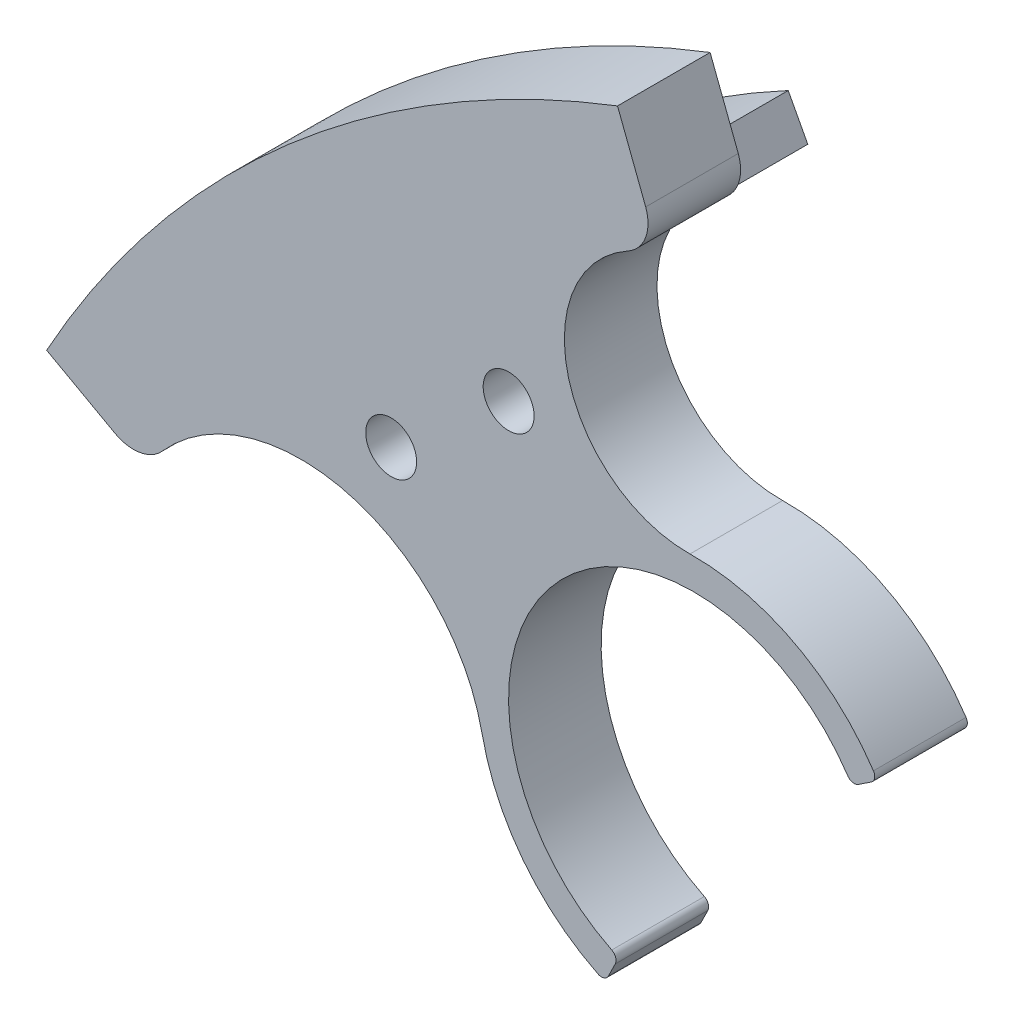
ISO-10303-21;
HEADER;
FILE_DESCRIPTION(('STEP AP214'),'2;1');
FILE_NAME('part.step','',(''),(''),'','','');
FILE_SCHEMA(('AUTOMOTIVE_DESIGN { 1 0 10303 214 1 1 1 1 }'));
ENDSEC;
DATA;
#1=APPLICATION_CONTEXT('core data for automotive mechanical design processes');
#2=APPLICATION_PROTOCOL_DEFINITION('international standard','automotive_design',2000,#1);
#3=PRODUCT_CONTEXT('',#1,'mechanical');
#4=PRODUCT('Part','Part','',(#3));
#5=PRODUCT_RELATED_PRODUCT_CATEGORY('part','',(#4));
#6=PRODUCT_DEFINITION_FORMATION('','',#4);
#7=PRODUCT_DEFINITION_CONTEXT('part definition',#1,'design');
#8=PRODUCT_DEFINITION('design','',#6,#7);
#9=PRODUCT_DEFINITION_SHAPE('','',#8);
#10=(LENGTH_UNIT() NAMED_UNIT(*) SI_UNIT(.MILLI.,.METRE.));
#11=(NAMED_UNIT(*) PLANE_ANGLE_UNIT() SI_UNIT($,.RADIAN.));
#12=(NAMED_UNIT(*) SI_UNIT($,.STERADIAN.) SOLID_ANGLE_UNIT());
#13=UNCERTAINTY_MEASURE_WITH_UNIT(LENGTH_MEASURE(1.E-05),#10,'distance_accuracy_value','');
#14=(GEOMETRIC_REPRESENTATION_CONTEXT(3) GLOBAL_UNCERTAINTY_ASSIGNED_CONTEXT((#13)) GLOBAL_UNIT_ASSIGNED_CONTEXT((#10,
#11,#12)) REPRESENTATION_CONTEXT('',''));
#15=CARTESIAN_POINT('',(0.,0.,0.));
#16=DIRECTION('',(0.,0.,1.));
#17=DIRECTION('',(1.,0.,0.));
#18=AXIS2_PLACEMENT_3D('',#15,#16,#17);
#19=CARTESIAN_POINT('',(0.,0.,6.));
#20=DIRECTION('',(0.,0.,-1.));
#21=DIRECTION('',(-1.,0.,0.));
#22=AXIS2_PLACEMENT_3D('',#19,#20,#21);
#23=CYLINDRICAL_SURFACE('',#22,71.545);
#24=CARTESIAN_POINT('',(0.,0.,0.));
#25=DIRECTION('',(0.,0.,1.));
#26=DIRECTION('',(-1.,0.,0.));
#27=AXIS2_PLACEMENT_3D('',#24,#25,#26);
#28=CIRCLE('',#27,71.545);
#29=CARTESIAN_POINT('',(-25.6394349502181,66.7930116137425,0.));
#30=VERTEX_POINT('',#29);
#31=CARTESIAN_POINT('',(-62.6290739033732,34.5873694721906,0.));
#32=VERTEX_POINT('',#31);
#33=EDGE_CURVE('E418',#30,#32,#28,.T.);
#34=ORIENTED_EDGE('',*,*,#33,.T.);
#35=DIRECTION('',(0.,0.,-1.));
#36=VECTOR('',#35,1.);
#37=CARTESIAN_POINT('',(-62.6290739033732,34.5873694721906,6.));
#38=LINE('',#37,#36);
#39=CARTESIAN_POINT('',(-62.6290739033732,34.5873694721906,6.));
#40=VERTEX_POINT('',#39);
#41=EDGE_CURVE('E429',#40,#32,#38,.T.);
#42=ORIENTED_EDGE('',*,*,#41,.F.);
#43=CARTESIAN_POINT('',(0.,0.,6.));
#44=DIRECTION('',(0.,0.,1.));
#45=DIRECTION('',(-1.,0.,0.));
#46=AXIS2_PLACEMENT_3D('',#43,#44,#45);
#47=CIRCLE('',#46,71.545);
#48=CARTESIAN_POINT('',(-25.6394349502181,66.7930116137425,6.));
#49=VERTEX_POINT('',#48);
#50=EDGE_CURVE('E419',#49,#40,#47,.T.);
#51=ORIENTED_EDGE('',*,*,#50,.F.);
#52=DIRECTION('',(0.,0.,-1.));
#53=VECTOR('',#52,1.);
#54=CARTESIAN_POINT('',(-25.6394349502181,66.7930116137425,6.));
#55=LINE('',#54,#53);
#56=EDGE_CURVE('E426',#49,#30,#55,.T.);
#57=ORIENTED_EDGE('',*,*,#56,.T.);
#58=EDGE_LOOP('',(#34,#42,#51,#57));
#59=FACE_BOUND('',#58,.T.);
#60=ADVANCED_FACE('F91',(#59),#23,.T.);
#61=CARTESIAN_POINT('',(-62.6290739033732,34.5873694721906,6.));
#62=DIRECTION('',(0.483435173278224,0.87538016497831,0.));
#63=DIRECTION('',(-0.87538016497831,0.483435173278225,0.));
#64=AXIS2_PLACEMENT_3D('',#61,#62,#63);
#65=PLANE('',#64);
#66=DIRECTION('',(0.87538016497831,-0.483435173278225,0.));
#67=VECTOR('',#66,1.);
#68=CARTESIAN_POINT('',(-62.6290739033732,34.5873694721906,0.));
#69=LINE('',#68,#67);
#70=CARTESIAN_POINT('',(-58.1699561421059,32.1247886943411,0.));
#71=VERTEX_POINT('',#70);
#72=EDGE_CURVE('E425',#32,#71,#69,.T.);
#73=ORIENTED_EDGE('',*,*,#72,.T.);
#74=DIRECTION('',(0.,0.,-1.));
#75=VECTOR('',#74,1.);
#76=CARTESIAN_POINT('',(-58.169956142106,32.1247886943412,6.));
#77=LINE('',#76,#75);
#78=CARTESIAN_POINT('',(-58.169956142106,32.1247886943412,6.));
#79=VERTEX_POINT('',#78);
#80=EDGE_CURVE('E100',#79,#71,#77,.T.);
#81=ORIENTED_EDGE('',*,*,#80,.F.);
#82=DIRECTION('',(0.87538016497831,-0.483435173278225,0.));
#83=VECTOR('',#82,1.);
#84=CARTESIAN_POINT('',(-62.6290739033732,34.5873694721906,6.));
#85=LINE('',#84,#83);
#86=EDGE_CURVE('E94',#40,#79,#85,.T.);
#87=ORIENTED_EDGE('',*,*,#86,.F.);
#88=ORIENTED_EDGE('',*,*,#41,.T.);
#89=EDGE_LOOP('',(#73,#81,#87,#88));
#90=FACE_BOUND('',#89,.T.);
#91=ADVANCED_FACE('F449',(#90),#65,.F.);
#92=CARTESIAN_POINT('',(-25.6394349502181,66.7930116137425,6.));
#93=DIRECTION('',(-0.933580426497203,-0.358367949545296,0.));
#94=DIRECTION('',(0.358367949545296,-0.933580426497203,0.));
#95=AXIS2_PLACEMENT_3D('',#92,#93,#94);
#96=PLANE('',#95);
#97=DIRECTION('',(-0.358367949545296,0.933580426497203,0.));
#98=VECTOR('',#97,1.);
#99=CARTESIAN_POINT('',(-25.6394349502181,66.7930116137425,0.));
#100=LINE('',#99,#98);
#101=CARTESIAN_POINT('',(-23.8139367806016,62.0374262944559,0.));
#102=VERTEX_POINT('',#101);
#103=EDGE_CURVE('E422',#102,#30,#100,.T.);
#104=ORIENTED_EDGE('',*,*,#103,.T.);
#105=ORIENTED_EDGE('',*,*,#56,.F.);
#106=DIRECTION('',(-0.358367949545296,0.933580426497203,0.));
#107=VECTOR('',#106,1.);
#108=CARTESIAN_POINT('',(-25.6394349502181,66.7930116137425,6.));
#109=LINE('',#108,#107);
#110=CARTESIAN_POINT('',(-23.8139367806016,62.0374262944559,6.));
#111=VERTEX_POINT('',#110);
#112=EDGE_CURVE('E108',#111,#49,#109,.T.);
#113=ORIENTED_EDGE('',*,*,#112,.F.);
#114=DIRECTION('',(0.,0.,-1.));
#115=VECTOR('',#114,1.);
#116=CARTESIAN_POINT('',(-23.8139367806016,62.0374262944559,6.));
#117=LINE('',#116,#115);
#118=EDGE_CURVE('E12',#102,#111,#117,.F.);
#119=ORIENTED_EDGE('',*,*,#118,.F.);
#120=EDGE_LOOP('',(#104,#105,#113,#119));
#121=FACE_BOUND('',#120,.T.);
#122=ADVANCED_FACE('F511',(#121),#96,.F.);
#123=CARTESIAN_POINT('',(0.,0.,6.));
#124=DIRECTION('',(0.,0.,-1.));
#125=DIRECTION('',(-1.,0.,0.));
#126=AXIS2_PLACEMENT_3D('',#123,#124,#125);
#127=PLANE('',#126);
#128=CARTESIAN_POINT('',(-40.305086527633,40.3050865276334,6.));
#129=DIRECTION('',(0.,0.,1.));
#130=DIRECTION('',(1.,0.,0.));
#131=AXIS2_PLACEMENT_3D('',#128,#129,#130);
#132=CIRCLE('',#131,1.65);
#133=CARTESIAN_POINT('',(-38.655086527633,40.3050865276334,6.));
#134=VERTEX_POINT('',#133);
#135=EDGE_CURVE('E321',#134,#134,#132,.T.);
#136=ORIENTED_EDGE('',*,*,#135,.F.);
#137=EDGE_LOOP('',(#136));
#138=FACE_BOUND('',#137,.T.);
#139=CARTESIAN_POINT('',(-32.6938568720097,46.6916665244725,6.));
#140=DIRECTION('',(0.,0.,1.));
#141=DIRECTION('',(1.,0.,0.));
#142=AXIS2_PLACEMENT_3D('',#139,#140,#141);
#143=CIRCLE('',#142,1.65);
#144=CARTESIAN_POINT('',(-31.0438568720097,46.6916665244725,6.));
#145=VERTEX_POINT('',#144);
#146=EDGE_CURVE('E287',#145,#145,#143,.T.);
#147=ORIENTED_EDGE('',*,*,#146,.F.);
#148=EDGE_LOOP('',(#147));
#149=FACE_BOUND('',#148,.T.);
#150=ORIENTED_EDGE('',*,*,#86,.T.);
#151=CARTESIAN_POINT('',(-57.0026899205681,34.3355554319362,6.));
#152=DIRECTION('',(0.,0.,1.));
#153=DIRECTION('',(1.,0.,0.));
#154=AXIS2_PLACEMENT_3D('',#151,#152,#153);
#155=CIRCLE('',#154,2.5);
#156=CARTESIAN_POINT('',(-55.1326712321369,32.6763296772789,6.));
#157=VERTEX_POINT('',#156);
#158=EDGE_CURVE('E346',#79,#157,#155,.T.);
#159=ORIENTED_EDGE('',*,*,#158,.T.);
#160=CARTESIAN_POINT('',(-46.156581527667,24.7120460549241,6.));
#161=DIRECTION('',(0.,0.,-1.));
#162=DIRECTION('',(-1.,0.,0.));
#163=AXIS2_PLACEMENT_3D('',#160,#161,#162);
#164=CIRCLE('',#163,12.);
#165=CARTESIAN_POINT('',(-34.4073900533592,27.1526401834206,6.));
#166=VERTEX_POINT('',#165);
#167=EDGE_CURVE('E348',#157,#166,#164,.T.);
#168=ORIENTED_EDGE('',*,*,#167,.T.);
#169=CARTESIAN_POINT('',(-20.7,30.,6.));
#170=DIRECTION('',(0.,0.,1.));
#171=DIRECTION('',(1.,0.,0.));
#172=AXIS2_PLACEMENT_3D('',#169,#170,#171);
#173=CIRCLE('',#172,14.);
#174=CARTESIAN_POINT('',(-26.8982489467865,17.4468446200304,6.));
#175=VERTEX_POINT('',#174);
#176=EDGE_CURVE('E350',#166,#175,#173,.T.);
#177=ORIENTED_EDGE('',*,*,#176,.T.);
#178=CARTESIAN_POINT('',(-26.6768829129727,17.8951715978864,6.));
#179=DIRECTION('',(0.,0.,1.));
#180=DIRECTION('',(1.,0.,0.));
#181=AXIS2_PLACEMENT_3D('',#178,#179,#180);
#182=CIRCLE('',#181,0.500000000000003);
#183=CARTESIAN_POINT('',(-26.2285559351166,17.6738055640726,6.));
#184=VERTEX_POINT('',#183);
#185=EDGE_CURVE('E352',#175,#184,#182,.T.);
#186=ORIENTED_EDGE('',*,*,#185,.T.);
#187=DIRECTION('',(0.442732067627607,0.896653955712115,0.));
#188=VECTOR('',#187,1.);
#189=CARTESIAN_POINT('',(-26.2285559351166,17.6738055640726,6.));
#190=LINE('',#189,#188);
#191=CARTESIAN_POINT('',(-25.785823867489,18.5704595197847,6.));
#192=VERTEX_POINT('',#191);
#193=EDGE_CURVE('E354',#184,#192,#190,.T.);
#194=ORIENTED_EDGE('',*,*,#193,.T.);
#195=CARTESIAN_POINT('',(-26.2341508453451,18.7918255535985,6.));
#196=DIRECTION('',(0.,0.,1.));
#197=DIRECTION('',(1.,0.,0.));
#198=AXIS2_PLACEMENT_3D('',#195,#196,#197);
#199=CIRCLE('',#198,0.499999999999999);
#200=CARTESIAN_POINT('',(-26.0127848115313,19.2401525314546,6.));
#201=VERTEX_POINT('',#200);
#202=EDGE_CURVE('E327',#192,#201,#199,.T.);
#203=ORIENTED_EDGE('',*,*,#202,.T.);
#204=CARTESIAN_POINT('',(-20.7,30.,6.));
#205=DIRECTION('',(0.,0.,-1.));
#206=DIRECTION('',(-1.,0.,0.));
#207=AXIS2_PLACEMENT_3D('',#204,#205,#206);
#208=CIRCLE('',#207,12.);
#209=CARTESIAN_POINT('',(-10.7190696541011,36.6619088428404,6.));
#210=VERTEX_POINT('',#209);
#211=EDGE_CURVE('E330',#201,#210,#208,.T.);
#212=ORIENTED_EDGE('',*,*,#211,.T.);
#213=CARTESIAN_POINT('',(-10.3031975563554,36.9394883779588,6.));
#214=DIRECTION('',(0.,0.,1.));
#215=DIRECTION('',(-1.,0.,0.));
#216=AXIS2_PLACEMENT_3D('',#213,#214,#215);
#217=CIRCLE('',#216,0.500000000000007);
#218=CARTESIAN_POINT('',(-10.025618021237,36.523616280213,6.));
#219=VERTEX_POINT('',#218);
#220=EDGE_CURVE('E333',#210,#219,#217,.T.);
#221=ORIENTED_EDGE('',*,*,#220,.T.);
#222=DIRECTION('',(0.831744195491571,0.555159070236702,0.));
#223=VECTOR('',#222,1.);
#224=CARTESIAN_POINT('',(-9.19387382574542,37.0787753504497,6.));
#225=LINE('',#224,#223);
#226=CARTESIAN_POINT('',(-9.19387382574542,37.0787753504497,6.));
#227=VERTEX_POINT('',#226);
#228=EDGE_CURVE('E335',#219,#227,#225,.T.);
#229=ORIENTED_EDGE('',*,*,#228,.T.);
#230=CARTESIAN_POINT('',(-9.47145336086377,37.4946474481955,6.));
#231=DIRECTION('',(0.,0.,1.));
#232=DIRECTION('',(-1.,0.,0.));
#233=AXIS2_PLACEMENT_3D('',#230,#231,#232);
#234=CIRCLE('',#233,0.500000000000005);
#235=CARTESIAN_POINT('',(-9.05558126311798,37.7722269833138,6.));
#236=VERTEX_POINT('',#235);
#237=EDGE_CURVE('E337',#227,#236,#234,.T.);
#238=ORIENTED_EDGE('',*,*,#237,.T.);
#239=CARTESIAN_POINT('',(-20.7,30.,6.));
#240=DIRECTION('',(0.,0.,1.));
#241=DIRECTION('',(1.,0.,0.));
#242=AXIS2_PLACEMENT_3D('',#239,#240,#241);
#243=CIRCLE('',#242,14.);
#244=CARTESIAN_POINT('',(-20.9440148083786,43.9978732946577,6.));
#245=VERTEX_POINT('',#244);
#246=EDGE_CURVE('E339',#236,#245,#243,.T.);
#247=ORIENTED_EDGE('',*,*,#246,.T.);
#248=CARTESIAN_POINT('',(-21.0834518417378,51.9966580344622,6.));
#249=DIRECTION('',(0.,0.,-1.));
#250=DIRECTION('',(1.,0.,0.));
#251=AXIS2_PLACEMENT_3D('',#248,#249,#250);
#252=CIRCLE('',#251,8.);
#253=CARTESIAN_POINT('',(-24.9545782518794,58.99768512459,6.));
#254=VERTEX_POINT('',#253);
#255=EDGE_CURVE('E341',#245,#254,#252,.T.);
#256=ORIENTED_EDGE('',*,*,#255,.T.);
#257=CARTESIAN_POINT('',(-26.1643052550486,61.185506090255,6.));
#258=DIRECTION('',(0.,0.,1.));
#259=DIRECTION('',(-1.,0.,0.));
#260=AXIS2_PLACEMENT_3D('',#257,#258,#259);
#261=CIRCLE('',#260,2.50000000000001);
#262=EDGE_CURVE('E343',#254,#111,#261,.T.);
#263=ORIENTED_EDGE('',*,*,#262,.T.);
#264=ORIENTED_EDGE('',*,*,#112,.T.);
#265=ORIENTED_EDGE('',*,*,#50,.T.);
#266=EDGE_LOOP('',(#150,#159,#168,#177,#186,#194,#203,#212,#221,#229,#238,#247,#256,#263,#264,#265));
#267=FACE_BOUND('',#266,.T.);
#268=ADVANCED_FACE('F442',(#138,#149,#267),#127,.F.);
#269=CARTESIAN_POINT('',(0.,0.,0.));
#270=DIRECTION('',(0.,0.,-1.));
#271=DIRECTION('',(-1.,0.,0.));
#272=AXIS2_PLACEMENT_3D('',#269,#270,#271);
#273=PLANE('',#272);
#274=CARTESIAN_POINT('',(-57.0026899205681,34.3355554319362,0.));
#275=DIRECTION('',(0.,0.,1.));
#276=DIRECTION('',(1.,0.,0.));
#277=AXIS2_PLACEMENT_3D('',#274,#275,#276);
#278=CIRCLE('',#277,2.5);
#279=CARTESIAN_POINT('',(-55.1326712321369,32.6763296772789,0.));
#280=VERTEX_POINT('',#279);
#281=EDGE_CURVE('E374',#71,#280,#278,.T.);
#282=ORIENTED_EDGE('',*,*,#281,.F.);
#283=ORIENTED_EDGE('',*,*,#72,.F.);
#284=ORIENTED_EDGE('',*,*,#33,.F.);
#285=ORIENTED_EDGE('',*,*,#103,.F.);
#286=CARTESIAN_POINT('',(-26.1643052550486,61.185506090255,0.));
#287=DIRECTION('',(0.,0.,1.));
#288=DIRECTION('',(-1.,0.,0.));
#289=AXIS2_PLACEMENT_3D('',#286,#287,#288);
#290=CIRCLE('',#289,2.50000000000001);
#291=CARTESIAN_POINT('',(-24.9545782518794,58.99768512459,0.));
#292=VERTEX_POINT('',#291);
#293=EDGE_CURVE('E371',#292,#102,#290,.T.);
#294=ORIENTED_EDGE('',*,*,#293,.F.);
#295=CARTESIAN_POINT('',(-21.0834518417378,51.9966580344622,0.));
#296=DIRECTION('',(0.,0.,-1.));
#297=DIRECTION('',(1.,0.,0.));
#298=AXIS2_PLACEMENT_3D('',#295,#296,#297);
#299=CIRCLE('',#298,8.);
#300=CARTESIAN_POINT('',(-20.9440148083786,43.9978732946577,0.));
#301=VERTEX_POINT('',#300);
#302=EDGE_CURVE('E369',#301,#292,#299,.T.);
#303=ORIENTED_EDGE('',*,*,#302,.F.);
#304=CARTESIAN_POINT('',(-20.7,30.,0.));
#305=DIRECTION('',(0.,0.,1.));
#306=DIRECTION('',(1.,0.,0.));
#307=AXIS2_PLACEMENT_3D('',#304,#305,#306);
#308=CIRCLE('',#307,14.);
#309=CARTESIAN_POINT('',(-9.05558126311798,37.7722269833138,0.));
#310=VERTEX_POINT('',#309);
#311=EDGE_CURVE('E367',#310,#301,#308,.T.);
#312=ORIENTED_EDGE('',*,*,#311,.F.);
#313=CARTESIAN_POINT('',(-9.47145336086377,37.4946474481955,0.));
#314=DIRECTION('',(0.,0.,1.));
#315=DIRECTION('',(-1.,0.,0.));
#316=AXIS2_PLACEMENT_3D('',#313,#314,#315);
#317=CIRCLE('',#316,0.500000000000005);
#318=CARTESIAN_POINT('',(-9.19387382574542,37.0787753504497,0.));
#319=VERTEX_POINT('',#318);
#320=EDGE_CURVE('E365',#319,#310,#317,.T.);
#321=ORIENTED_EDGE('',*,*,#320,.F.);
#322=DIRECTION('',(0.831744195491571,0.555159070236702,0.));
#323=VECTOR('',#322,1.);
#324=CARTESIAN_POINT('',(-9.19387382574542,37.0787753504497,0.));
#325=LINE('',#324,#323);
#326=CARTESIAN_POINT('',(-10.025618021237,36.523616280213,0.));
#327=VERTEX_POINT('',#326);
#328=EDGE_CURVE('E363',#327,#319,#325,.T.);
#329=ORIENTED_EDGE('',*,*,#328,.F.);
#330=CARTESIAN_POINT('',(-10.3031975563554,36.9394883779588,0.));
#331=DIRECTION('',(0.,0.,1.));
#332=DIRECTION('',(-1.,0.,0.));
#333=AXIS2_PLACEMENT_3D('',#330,#331,#332);
#334=CIRCLE('',#333,0.500000000000007);
#335=CARTESIAN_POINT('',(-10.7190696541011,36.6619088428404,0.));
#336=VERTEX_POINT('',#335);
#337=EDGE_CURVE('E361',#336,#327,#334,.T.);
#338=ORIENTED_EDGE('',*,*,#337,.F.);
#339=CARTESIAN_POINT('',(-20.7,30.,0.));
#340=DIRECTION('',(0.,0.,-1.));
#341=DIRECTION('',(-1.,0.,0.));
#342=AXIS2_PLACEMENT_3D('',#339,#340,#341);
#343=CIRCLE('',#342,12.);
#344=CARTESIAN_POINT('',(-26.0127848115313,19.2401525314546,0.));
#345=VERTEX_POINT('',#344);
#346=EDGE_CURVE('E359',#345,#336,#343,.T.);
#347=ORIENTED_EDGE('',*,*,#346,.F.);
#348=CARTESIAN_POINT('',(-26.2341508453451,18.7918255535985,0.));
#349=DIRECTION('',(0.,0.,1.));
#350=DIRECTION('',(1.,0.,0.));
#351=AXIS2_PLACEMENT_3D('',#348,#349,#350);
#352=CIRCLE('',#351,0.499999999999999);
#353=CARTESIAN_POINT('',(-25.785823867489,18.5704595197847,0.));
#354=VERTEX_POINT('',#353);
#355=EDGE_CURVE('E324',#354,#345,#352,.T.);
#356=ORIENTED_EDGE('',*,*,#355,.F.);
#357=DIRECTION('',(0.442732067627607,0.896653955712115,0.));
#358=VECTOR('',#357,1.);
#359=CARTESIAN_POINT('',(-26.2285559351166,17.6738055640726,0.));
#360=LINE('',#359,#358);
#361=CARTESIAN_POINT('',(-26.2285559351166,17.6738055640726,0.));
#362=VERTEX_POINT('',#361);
#363=EDGE_CURVE('E331',#362,#354,#360,.T.);
#364=ORIENTED_EDGE('',*,*,#363,.F.);
#365=CARTESIAN_POINT('',(-26.6768829129727,17.8951715978864,0.));
#366=DIRECTION('',(0.,0.,1.));
#367=DIRECTION('',(1.,0.,0.));
#368=AXIS2_PLACEMENT_3D('',#365,#366,#367);
#369=CIRCLE('',#368,0.500000000000003);
#370=CARTESIAN_POINT('',(-26.8982489467865,17.4468446200304,0.));
#371=VERTEX_POINT('',#370);
#372=EDGE_CURVE('E380',#371,#362,#369,.T.);
#373=ORIENTED_EDGE('',*,*,#372,.F.);
#374=CARTESIAN_POINT('',(-20.7,30.,0.));
#375=DIRECTION('',(0.,0.,1.));
#376=DIRECTION('',(1.,0.,0.));
#377=AXIS2_PLACEMENT_3D('',#374,#375,#376);
#378=CIRCLE('',#377,14.);
#379=CARTESIAN_POINT('',(-34.4073900533592,27.1526401834206,0.));
#380=VERTEX_POINT('',#379);
#381=EDGE_CURVE('E378',#380,#371,#378,.T.);
#382=ORIENTED_EDGE('',*,*,#381,.F.);
#383=CARTESIAN_POINT('',(-46.156581527667,24.7120460549241,0.));
#384=DIRECTION('',(0.,0.,-1.));
#385=DIRECTION('',(-1.,0.,0.));
#386=AXIS2_PLACEMENT_3D('',#383,#384,#385);
#387=CIRCLE('',#386,12.);
#388=EDGE_CURVE('E376',#280,#380,#387,.T.);
#389=ORIENTED_EDGE('',*,*,#388,.F.);
#390=EDGE_LOOP('',(#282,#283,#284,#285,#294,#303,#312,#321,#329,#338,#347,#356,#364,#373,#382,#389));
#391=FACE_BOUND('',#390,.T.);
#392=CARTESIAN_POINT('',(-40.305086527633,40.3050865276334,0.));
#393=DIRECTION('',(0.,0.,1.));
#394=DIRECTION('',(1.,0.,0.));
#395=AXIS2_PLACEMENT_3D('',#392,#393,#394);
#396=CIRCLE('',#395,2.75);
#397=CARTESIAN_POINT('',(-37.555086527633,40.3050865276334,0.));
#398=VERTEX_POINT('',#397);
#399=EDGE_CURVE('E522',#398,#398,#396,.T.);
#400=ORIENTED_EDGE('',*,*,#399,.T.);
#401=EDGE_LOOP('',(#400));
#402=FACE_BOUND('',#401,.T.);
#403=CARTESIAN_POINT('',(-32.6938568720097,46.6916665244725,0.));
#404=DIRECTION('',(0.,0.,1.));
#405=DIRECTION('',(1.,0.,0.));
#406=AXIS2_PLACEMENT_3D('',#403,#404,#405);
#407=CIRCLE('',#406,2.75);
#408=CARTESIAN_POINT('',(-29.9438568720097,46.6916665244725,0.));
#409=VERTEX_POINT('',#408);
#410=EDGE_CURVE('E526',#409,#409,#407,.T.);
#411=ORIENTED_EDGE('',*,*,#410,.T.);
#412=EDGE_LOOP('',(#411));
#413=FACE_BOUND('',#412,.T.);
#414=DIRECTION('',(0.642787609686536,-0.766044443118981,0.));
#415=VECTOR('',#414,1.);
#416=CARTESIAN_POINT('',(0.114906666467888,0.0964181414530143,0.));
#417=LINE('',#416,#415);
#418=CARTESIAN_POINT('',(-41.5697583125246,49.7742673862539,0.));
#419=VERTEX_POINT('',#418);
#420=CARTESIAN_POINT('',(-39.8342269220324,47.7059416165747,0.));
#421=VERTEX_POINT('',#420);
#422=EDGE_CURVE('E305',#419,#421,#417,.T.);
#423=ORIENTED_EDGE('',*,*,#422,.T.);
#424=CARTESIAN_POINT('',(0.,0.,0.));
#425=DIRECTION('',(0.,0.,-1.));
#426=DIRECTION('',(0.,-1.,0.));
#427=AXIS2_PLACEMENT_3D('',#424,#425,#426);
#428=CIRCLE('',#427,62.15);
#429=CARTESIAN_POINT('',(-29.3100147851746,54.8046123359416,0.));
#430=VERTEX_POINT('',#429);
#431=EDGE_CURVE('E309',#421,#430,#428,.T.);
#432=ORIENTED_EDGE('',*,*,#431,.T.);
#433=DIRECTION('',(-0.469471562785891,0.882947592858927,0.));
#434=VECTOR('',#433,1.);
#435=CARTESIAN_POINT('',(-0.132442138928858,-0.0704207344178939,0.));
#436=LINE('',#435,#434);
#437=CARTESIAN_POINT('',(-30.5775915428469,57.1885774909537,0.));
#438=VERTEX_POINT('',#437);
#439=EDGE_CURVE('E293',#430,#438,#436,.T.);
#440=ORIENTED_EDGE('',*,*,#439,.T.);
#441=CARTESIAN_POINT('',(0.,0.,0.));
#442=DIRECTION('',(0.,0.,-1.));
#443=DIRECTION('',(0.,-1.,0.));
#444=AXIS2_PLACEMENT_3D('',#441,#442,#443);
#445=CIRCLE('',#444,64.85);
#446=EDGE_CURVE('E303',#438,#419,#445,.F.);
#447=ORIENTED_EDGE('',*,*,#446,.T.);
#448=EDGE_LOOP('',(#423,#432,#440,#447));
#449=FACE_BOUND('',#448,.T.);
#450=DIRECTION('',(0.798635510047282,-0.601815023152063,0.));
#451=VECTOR('',#450,1.);
#452=CARTESIAN_POINT('',(0.0902722534728621,0.119795326507162,0.));
#453=LINE('',#452,#451);
#454=CARTESIAN_POINT('',(-51.7011020278119,39.1473951765605,0.));
#455=VERTEX_POINT('',#454);
#456=CARTESIAN_POINT('',(-49.5447801318053,37.5224900784993,0.));
#457=VERTEX_POINT('',#456);
#458=EDGE_CURVE('E280',#455,#457,#453,.T.);
#459=ORIENTED_EDGE('',*,*,#458,.T.);
#460=CARTESIAN_POINT('',(0.,0.,0.));
#461=DIRECTION('',(0.,0.,-1.));
#462=DIRECTION('',(0.,-1.,0.));
#463=AXIS2_PLACEMENT_3D('',#460,#461,#462);
#464=CIRCLE('',#463,62.15);
#465=CARTESIAN_POINT('',(-44.0526244717368,43.8404924373819,0.));
#466=VERTEX_POINT('',#465);
#467=EDGE_CURVE('E284',#457,#466,#464,.T.);
#468=ORIENTED_EDGE('',*,*,#467,.T.);
#469=DIRECTION('',(-0.707106781186538,0.707106781186557,0.));
#470=VECTOR('',#469,1.);
#471=CARTESIAN_POINT('',(-0.106066017178016,-0.106066017178013,0.));
#472=LINE('',#471,#470);
#473=CARTESIAN_POINT('',(-45.9618181100174,45.7496860756626,0.));
#474=VERTEX_POINT('',#473);
#475=EDGE_CURVE('E255',#466,#474,#472,.T.);
#476=ORIENTED_EDGE('',*,*,#475,.T.);
#477=CARTESIAN_POINT('',(0.,0.,0.));
#478=DIRECTION('',(0.,0.,-1.));
#479=DIRECTION('',(0.,-1.,0.));
#480=AXIS2_PLACEMENT_3D('',#477,#478,#479);
#481=CIRCLE('',#480,64.85);
#482=EDGE_CURVE('E278',#474,#455,#481,.F.);
#483=ORIENTED_EDGE('',*,*,#482,.T.);
#484=EDGE_LOOP('',(#459,#468,#476,#483));
#485=FACE_BOUND('',#484,.T.);
#486=ADVANCED_FACE('F515',(#391,#402,#413,#449,#485),#273,.T.);
#487=CARTESIAN_POINT('',(-26.2341508453451,18.7918255535985,6.));
#488=DIRECTION('',(0.,0.,-1.));
#489=DIRECTION('',(-1.,0.,0.));
#490=AXIS2_PLACEMENT_3D('',#487,#488,#489);
#491=CYLINDRICAL_SURFACE('',#490,0.499999999999999);
#492=ORIENTED_EDGE('',*,*,#355,.T.);
#493=DIRECTION('',(0.,0.,-1.));
#494=VECTOR('',#493,1.);
#495=CARTESIAN_POINT('',(-26.0127848115313,19.2401525314546,6.));
#496=LINE('',#495,#494);
#497=EDGE_CURVE('E415',#201,#345,#496,.T.);
#498=ORIENTED_EDGE('',*,*,#497,.F.);
#499=ORIENTED_EDGE('',*,*,#202,.F.);
#500=DIRECTION('',(0.,0.,-1.));
#501=VECTOR('',#500,1.);
#502=CARTESIAN_POINT('',(-25.785823867489,18.5704595197847,6.));
#503=LINE('',#502,#501);
#504=EDGE_CURVE('E356',#192,#354,#503,.T.);
#505=ORIENTED_EDGE('',*,*,#504,.T.);
#506=EDGE_LOOP('',(#492,#498,#499,#505));
#507=FACE_BOUND('',#506,.T.);
#508=ADVANCED_FACE('F478',(#507),#491,.T.);
#509=CARTESIAN_POINT('',(-20.7,30.,6.));
#510=DIRECTION('',(0.,0.,-1.));
#511=DIRECTION('',(-1.,0.,0.));
#512=AXIS2_PLACEMENT_3D('',#509,#510,#511);
#513=CYLINDRICAL_SURFACE('',#512,12.);
#514=ORIENTED_EDGE('',*,*,#346,.T.);
#515=DIRECTION('',(0.,0.,-1.));
#516=VECTOR('',#515,1.);
#517=CARTESIAN_POINT('',(-10.7190696541011,36.6619088428404,6.));
#518=LINE('',#517,#516);
#519=EDGE_CURVE('E412',#210,#336,#518,.T.);
#520=ORIENTED_EDGE('',*,*,#519,.F.);
#521=ORIENTED_EDGE('',*,*,#211,.F.);
#522=ORIENTED_EDGE('',*,*,#497,.T.);
#523=EDGE_LOOP('',(#514,#520,#521,#522));
#524=FACE_BOUND('',#523,.T.);
#525=ADVANCED_FACE('F481',(#524),#513,.F.);
#526=CARTESIAN_POINT('',(-10.3031975563554,36.9394883779588,6.));
#527=DIRECTION('',(0.,0.,-1.));
#528=DIRECTION('',(-1.,0.,0.));
#529=AXIS2_PLACEMENT_3D('',#526,#527,#528);
#530=CYLINDRICAL_SURFACE('',#529,0.500000000000007);
#531=ORIENTED_EDGE('',*,*,#337,.T.);
#532=DIRECTION('',(0.,0.,-1.));
#533=VECTOR('',#532,1.);
#534=CARTESIAN_POINT('',(-10.025618021237,36.523616280213,6.));
#535=LINE('',#534,#533);
#536=EDGE_CURVE('E409',#219,#327,#535,.T.);
#537=ORIENTED_EDGE('',*,*,#536,.F.);
#538=ORIENTED_EDGE('',*,*,#220,.F.);
#539=ORIENTED_EDGE('',*,*,#519,.T.);
#540=EDGE_LOOP('',(#531,#537,#538,#539));
#541=FACE_BOUND('',#540,.T.);
#542=ADVANCED_FACE('F486',(#541),#530,.T.);
#543=CARTESIAN_POINT('',(-9.19387382574542,37.0787753504497,6.));
#544=DIRECTION('',(-0.555159070236702,0.831744195491571,0.));
#545=DIRECTION('',(-0.831744195491571,-0.555159070236702,0.));
#546=AXIS2_PLACEMENT_3D('',#543,#544,#545);
#547=PLANE('',#546);
#548=ORIENTED_EDGE('',*,*,#328,.T.);
#549=DIRECTION('',(0.,0.,-1.));
#550=VECTOR('',#549,1.);
#551=CARTESIAN_POINT('',(-9.19387382574542,37.0787753504497,6.));
#552=LINE('',#551,#550);
#553=EDGE_CURVE('E406',#227,#319,#552,.T.);
#554=ORIENTED_EDGE('',*,*,#553,.F.);
#555=ORIENTED_EDGE('',*,*,#228,.F.);
#556=ORIENTED_EDGE('',*,*,#536,.T.);
#557=EDGE_LOOP('',(#548,#554,#555,#556));
#558=FACE_BOUND('',#557,.T.);
#559=ADVANCED_FACE('F492',(#558),#547,.F.);
#560=CARTESIAN_POINT('',(-9.47145336086377,37.4946474481955,6.));
#561=DIRECTION('',(0.,0.,-1.));
#562=DIRECTION('',(-1.,0.,0.));
#563=AXIS2_PLACEMENT_3D('',#560,#561,#562);
#564=CYLINDRICAL_SURFACE('',#563,0.500000000000005);
#565=ORIENTED_EDGE('',*,*,#320,.T.);
#566=DIRECTION('',(0.,0.,-1.));
#567=VECTOR('',#566,1.);
#568=CARTESIAN_POINT('',(-9.05558126311798,37.7722269833138,6.));
#569=LINE('',#568,#567);
#570=EDGE_CURVE('E403',#236,#310,#569,.T.);
#571=ORIENTED_EDGE('',*,*,#570,.F.);
#572=ORIENTED_EDGE('',*,*,#237,.F.);
#573=ORIENTED_EDGE('',*,*,#553,.T.);
#574=EDGE_LOOP('',(#565,#571,#572,#573));
#575=FACE_BOUND('',#574,.T.);
#576=ADVANCED_FACE('F496',(#575),#564,.T.);
#577=CARTESIAN_POINT('',(-20.7,30.,6.));
#578=DIRECTION('',(0.,0.,-1.));
#579=DIRECTION('',(-1.,0.,0.));
#580=AXIS2_PLACEMENT_3D('',#577,#578,#579);
#581=CYLINDRICAL_SURFACE('',#580,14.);
#582=ORIENTED_EDGE('',*,*,#311,.T.);
#583=DIRECTION('',(0.,0.,-1.));
#584=VECTOR('',#583,1.);
#585=CARTESIAN_POINT('',(-20.9440148083786,43.9978732946577,6.));
#586=LINE('',#585,#584);
#587=EDGE_CURVE('E400',#245,#301,#586,.T.);
#588=ORIENTED_EDGE('',*,*,#587,.F.);
#589=ORIENTED_EDGE('',*,*,#246,.F.);
#590=ORIENTED_EDGE('',*,*,#570,.T.);
#591=EDGE_LOOP('',(#582,#588,#589,#590));
#592=FACE_BOUND('',#591,.T.);
#593=ADVANCED_FACE('F501',(#592),#581,.T.);
#594=CARTESIAN_POINT('',(-21.0834518417378,51.9966580344622,6.));
#595=DIRECTION('',(0.,0.,-1.));
#596=DIRECTION('',(-1.,0.,0.));
#597=AXIS2_PLACEMENT_3D('',#594,#595,#596);
#598=CYLINDRICAL_SURFACE('',#597,8.);
#599=ORIENTED_EDGE('',*,*,#302,.T.);
#600=DIRECTION('',(0.,0.,-1.));
#601=VECTOR('',#600,1.);
#602=CARTESIAN_POINT('',(-24.9545782518794,58.99768512459,6.));
#603=LINE('',#602,#601);
#604=EDGE_CURVE('E397',#254,#292,#603,.T.);
#605=ORIENTED_EDGE('',*,*,#604,.F.);
#606=ORIENTED_EDGE('',*,*,#255,.F.);
#607=ORIENTED_EDGE('',*,*,#587,.T.);
#608=EDGE_LOOP('',(#599,#605,#606,#607));
#609=FACE_BOUND('',#608,.T.);
#610=ADVANCED_FACE('F506',(#609),#598,.F.);
#611=CARTESIAN_POINT('',(-26.1643052550486,61.185506090255,6.));
#612=DIRECTION('',(0.,0.,-1.));
#613=DIRECTION('',(-1.,0.,0.));
#614=AXIS2_PLACEMENT_3D('',#611,#612,#613);
#615=CYLINDRICAL_SURFACE('',#614,2.50000000000001);
#616=ORIENTED_EDGE('',*,*,#293,.T.);
#617=ORIENTED_EDGE('',*,*,#118,.T.);
#618=ORIENTED_EDGE('',*,*,#262,.F.);
#619=ORIENTED_EDGE('',*,*,#604,.T.);
#620=EDGE_LOOP('',(#616,#617,#618,#619));
#621=FACE_BOUND('',#620,.T.);
#622=ADVANCED_FACE('F510',(#621),#615,.T.);
#623=CARTESIAN_POINT('',(-57.0026899205681,34.3355554319362,6.));
#624=DIRECTION('',(0.,0.,-1.));
#625=DIRECTION('',(-1.,0.,0.));
#626=AXIS2_PLACEMENT_3D('',#623,#624,#625);
#627=CYLINDRICAL_SURFACE('',#626,2.5);
#628=ORIENTED_EDGE('',*,*,#158,.F.);
#629=ORIENTED_EDGE('',*,*,#80,.T.);
#630=ORIENTED_EDGE('',*,*,#281,.T.);
#631=DIRECTION('',(0.,0.,-1.));
#632=VECTOR('',#631,1.);
#633=CARTESIAN_POINT('',(-55.1326712321369,32.6763296772789,6.));
#634=LINE('',#633,#632);
#635=EDGE_CURVE('E394',#157,#280,#634,.T.);
#636=ORIENTED_EDGE('',*,*,#635,.F.);
#637=EDGE_LOOP('',(#628,#629,#630,#636));
#638=FACE_BOUND('',#637,.T.);
#639=ADVANCED_FACE('F453',(#638),#627,.T.);
#640=CARTESIAN_POINT('',(-46.156581527667,24.7120460549241,6.));
#641=DIRECTION('',(0.,0.,-1.));
#642=DIRECTION('',(-1.,0.,0.));
#643=AXIS2_PLACEMENT_3D('',#640,#641,#642);
#644=CYLINDRICAL_SURFACE('',#643,12.);
#645=ORIENTED_EDGE('',*,*,#388,.T.);
#646=DIRECTION('',(0.,0.,-1.));
#647=VECTOR('',#646,1.);
#648=CARTESIAN_POINT('',(-34.4073900533592,27.1526401834206,6.));
#649=LINE('',#648,#647);
#650=EDGE_CURVE('E391',#166,#380,#649,.T.);
#651=ORIENTED_EDGE('',*,*,#650,.F.);
#652=ORIENTED_EDGE('',*,*,#167,.F.);
#653=ORIENTED_EDGE('',*,*,#635,.T.);
#654=EDGE_LOOP('',(#645,#651,#652,#653));
#655=FACE_BOUND('',#654,.T.);
#656=ADVANCED_FACE('F458',(#655),#644,.F.);
#657=CARTESIAN_POINT('',(-20.7,30.,6.));
#658=DIRECTION('',(0.,0.,-1.));
#659=DIRECTION('',(-1.,0.,0.));
#660=AXIS2_PLACEMENT_3D('',#657,#658,#659);
#661=CYLINDRICAL_SURFACE('',#660,14.);
#662=ORIENTED_EDGE('',*,*,#381,.T.);
#663=DIRECTION('',(0.,0.,-1.));
#664=VECTOR('',#663,1.);
#665=CARTESIAN_POINT('',(-26.8982489467865,17.4468446200304,6.));
#666=LINE('',#665,#664);
#667=EDGE_CURVE('E388',#175,#371,#666,.T.);
#668=ORIENTED_EDGE('',*,*,#667,.F.);
#669=ORIENTED_EDGE('',*,*,#176,.F.);
#670=ORIENTED_EDGE('',*,*,#650,.T.);
#671=EDGE_LOOP('',(#662,#668,#669,#670));
#672=FACE_BOUND('',#671,.T.);
#673=ADVANCED_FACE('F464',(#672),#661,.T.);
#674=CARTESIAN_POINT('',(-26.6768829129727,17.8951715978864,6.));
#675=DIRECTION('',(0.,0.,-1.));
#676=DIRECTION('',(-1.,0.,0.));
#677=AXIS2_PLACEMENT_3D('',#674,#675,#676);
#678=CYLINDRICAL_SURFACE('',#677,0.500000000000003);
#679=ORIENTED_EDGE('',*,*,#372,.T.);
#680=DIRECTION('',(0.,0.,-1.));
#681=VECTOR('',#680,1.);
#682=CARTESIAN_POINT('',(-26.2285559351166,17.6738055640726,6.));
#683=LINE('',#682,#681);
#684=EDGE_CURVE('E385',#184,#362,#683,.T.);
#685=ORIENTED_EDGE('',*,*,#684,.F.);
#686=ORIENTED_EDGE('',*,*,#185,.F.);
#687=ORIENTED_EDGE('',*,*,#667,.T.);
#688=EDGE_LOOP('',(#679,#685,#686,#687));
#689=FACE_BOUND('',#688,.T.);
#690=ADVANCED_FACE('F468',(#689),#678,.T.);
#691=CARTESIAN_POINT('',(-26.2285559351166,17.6738055640726,6.));
#692=DIRECTION('',(-0.896653955712115,0.442732067627607,0.));
#693=DIRECTION('',(-0.442732067627607,-0.896653955712115,0.));
#694=AXIS2_PLACEMENT_3D('',#691,#692,#693);
#695=PLANE('',#694);
#696=ORIENTED_EDGE('',*,*,#363,.T.);
#697=ORIENTED_EDGE('',*,*,#504,.F.);
#698=ORIENTED_EDGE('',*,*,#193,.F.);
#699=ORIENTED_EDGE('',*,*,#684,.T.);
#700=EDGE_LOOP('',(#696,#697,#698,#699));
#701=FACE_BOUND('',#700,.T.);
#702=ADVANCED_FACE('F473',(#701),#695,.F.);
#703=CARTESIAN_POINT('',(-32.6938568720097,46.6916665244725,6.));
#704=DIRECTION('',(0.,0.,-1.));
#705=DIRECTION('',(-1.,0.,0.));
#706=AXIS2_PLACEMENT_3D('',#703,#704,#705);
#707=CYLINDRICAL_SURFACE('',#706,1.65);
#708=CARTESIAN_POINT('',(-32.6938568720097,46.6916665244725,3.));
#709=DIRECTION('',(0.,0.,1.));
#710=DIRECTION('',(1.,0.,0.));
#711=AXIS2_PLACEMENT_3D('',#708,#709,#710);
#712=CIRCLE('',#711,1.65);
#713=CARTESIAN_POINT('',(-31.0438568720097,46.6916665244725,3.));
#714=VERTEX_POINT('',#713);
#715=EDGE_CURVE('E306',#714,#714,#712,.T.);
#716=ORIENTED_EDGE('',*,*,#715,.F.);
#717=EDGE_LOOP('',(#716));
#718=FACE_BOUND('',#717,.T.);
#719=ORIENTED_EDGE('',*,*,#146,.T.);
#720=EDGE_LOOP('',(#719));
#721=FACE_BOUND('',#720,.T.);
#722=ADVANCED_FACE('F601',(#718,#721),#707,.F.);
#723=CARTESIAN_POINT('',(-40.305086527633,40.3050865276334,6.));
#724=DIRECTION('',(0.,0.,-1.));
#725=DIRECTION('',(-1.,0.,0.));
#726=AXIS2_PLACEMENT_3D('',#723,#724,#725);
#727=CYLINDRICAL_SURFACE('',#726,1.65);
#728=CARTESIAN_POINT('',(-40.305086527633,40.3050865276334,3.));
#729=DIRECTION('',(0.,0.,1.));
#730=DIRECTION('',(1.,0.,0.));
#731=AXIS2_PLACEMENT_3D('',#728,#729,#730);
#732=CIRCLE('',#731,1.65);
#733=CARTESIAN_POINT('',(-38.655086527633,40.3050865276334,3.));
#734=VERTEX_POINT('',#733);
#735=EDGE_CURVE('E432',#734,#734,#732,.T.);
#736=ORIENTED_EDGE('',*,*,#735,.F.);
#737=EDGE_LOOP('',(#736));
#738=FACE_BOUND('',#737,.T.);
#739=ORIENTED_EDGE('',*,*,#135,.T.);
#740=EDGE_LOOP('',(#739));
#741=FACE_BOUND('',#740,.T.);
#742=ADVANCED_FACE('F604',(#738,#741),#727,.F.);
#743=CARTESIAN_POINT('',(0.,0.,-10.));
#744=DIRECTION('',(0.,0.,1.));
#745=DIRECTION('',(1.,0.,0.));
#746=AXIS2_PLACEMENT_3D('',#743,#744,#745);
#747=CYLINDRICAL_SURFACE('',#746,64.85);
#748=ORIENTED_EDGE('',*,*,#482,.F.);
#749=DIRECTION('',(0.,0.,1.));
#750=VECTOR('',#749,1.);
#751=CARTESIAN_POINT('',(-45.9618181100174,45.7496860756626,-10.));
#752=LINE('',#751,#750);
#753=CARTESIAN_POINT('',(-45.9618181100174,45.7496860756626,-10.));
#754=VERTEX_POINT('',#753);
#755=EDGE_CURVE('E259',#754,#474,#752,.T.);
#756=ORIENTED_EDGE('',*,*,#755,.F.);
#757=CARTESIAN_POINT('',(0.,0.,-10.));
#758=DIRECTION('',(0.,0.,-1.));
#759=DIRECTION('',(0.,-1.,0.));
#760=AXIS2_PLACEMENT_3D('',#757,#758,#759);
#761=CIRCLE('',#760,64.85);
#762=CARTESIAN_POINT('',(-51.7011020278119,39.1473951765605,-10.));
#763=VERTEX_POINT('',#762);
#764=EDGE_CURVE('E271',#754,#763,#761,.F.);
#765=ORIENTED_EDGE('',*,*,#764,.T.);
#766=DIRECTION('',(0.,0.,1.));
#767=VECTOR('',#766,1.);
#768=CARTESIAN_POINT('',(-51.7011020278119,39.1473951765605,-10.));
#769=LINE('',#768,#767);
#770=EDGE_CURVE('E272',#763,#455,#769,.T.);
#771=ORIENTED_EDGE('',*,*,#770,.T.);
#772=EDGE_LOOP('',(#748,#756,#765,#771));
#773=FACE_BOUND('',#772,.T.);
#774=ADVANCED_FACE('F608',(#773),#747,.T.);
#775=CARTESIAN_POINT('',(-0.106066017178016,-0.106066017178013,-10.));
#776=DIRECTION('',(0.707106781186557,0.707106781186538,0.));
#777=DIRECTION('',(-0.707106781186538,0.707106781186557,0.));
#778=AXIS2_PLACEMENT_3D('',#775,#776,#777);
#779=PLANE('',#778);
#780=ORIENTED_EDGE('',*,*,#475,.F.);
#781=DIRECTION('',(0.,0.,1.));
#782=VECTOR('',#781,1.);
#783=CARTESIAN_POINT('',(-44.0526244717368,43.8404924373819,-10.));
#784=LINE('',#783,#782);
#785=CARTESIAN_POINT('',(-44.0526244717368,43.8404924373819,-10.));
#786=VERTEX_POINT('',#785);
#787=EDGE_CURVE('E248',#786,#466,#784,.T.);
#788=ORIENTED_EDGE('',*,*,#787,.F.);
#789=DIRECTION('',(-0.707106781186538,0.707106781186557,0.));
#790=VECTOR('',#789,1.);
#791=CARTESIAN_POINT('',(-0.106066017178016,-0.106066017178013,-10.));
#792=LINE('',#791,#790);
#793=EDGE_CURVE('E252',#786,#754,#792,.T.);
#794=ORIENTED_EDGE('',*,*,#793,.T.);
#795=ORIENTED_EDGE('',*,*,#755,.T.);
#796=EDGE_LOOP('',(#780,#788,#794,#795));
#797=FACE_BOUND('',#796,.T.);
#798=ADVANCED_FACE('F250',(#797),#779,.T.);
#799=CARTESIAN_POINT('',(0.,0.,-10.));
#800=DIRECTION('',(0.,0.,1.));
#801=DIRECTION('',(1.,0.,0.));
#802=AXIS2_PLACEMENT_3D('',#799,#800,#801);
#803=CYLINDRICAL_SURFACE('',#802,62.15);
#804=ORIENTED_EDGE('',*,*,#467,.F.);
#805=DIRECTION('',(0.,0.,1.));
#806=VECTOR('',#805,1.);
#807=CARTESIAN_POINT('',(-49.5447801318053,37.5224900784993,-10.));
#808=LINE('',#807,#806);
#809=CARTESIAN_POINT('',(-49.5447801318053,37.5224900784993,-10.));
#810=VERTEX_POINT('',#809);
#811=EDGE_CURVE('E260',#810,#457,#808,.T.);
#812=ORIENTED_EDGE('',*,*,#811,.F.);
#813=CARTESIAN_POINT('',(0.,0.,-10.));
#814=DIRECTION('',(0.,0.,-1.));
#815=DIRECTION('',(0.,-1.,0.));
#816=AXIS2_PLACEMENT_3D('',#813,#814,#815);
#817=CIRCLE('',#816,62.15);
#818=EDGE_CURVE('E263',#810,#786,#817,.T.);
#819=ORIENTED_EDGE('',*,*,#818,.T.);
#820=ORIENTED_EDGE('',*,*,#787,.T.);
#821=EDGE_LOOP('',(#804,#812,#819,#820));
#822=FACE_BOUND('',#821,.T.);
#823=ADVANCED_FACE('F264',(#822),#803,.F.);
#824=CARTESIAN_POINT('',(0.0902722534728621,0.119795326507162,-10.));
#825=DIRECTION('',(-0.601815023152063,-0.798635510047282,0.));
#826=DIRECTION('',(0.798635510047282,-0.601815023152063,0.));
#827=AXIS2_PLACEMENT_3D('',#824,#825,#826);
#828=PLANE('',#827);
#829=ORIENTED_EDGE('',*,*,#458,.F.);
#830=ORIENTED_EDGE('',*,*,#770,.F.);
#831=DIRECTION('',(0.798635510047282,-0.601815023152063,0.));
#832=VECTOR('',#831,1.);
#833=CARTESIAN_POINT('',(0.0902722534728621,0.119795326507162,-10.));
#834=LINE('',#833,#832);
#835=EDGE_CURVE('E268',#763,#810,#834,.T.);
#836=ORIENTED_EDGE('',*,*,#835,.T.);
#837=ORIENTED_EDGE('',*,*,#811,.T.);
#838=EDGE_LOOP('',(#829,#830,#836,#837));
#839=FACE_BOUND('',#838,.T.);
#840=ADVANCED_FACE('F534',(#839),#828,.T.);
#841=CARTESIAN_POINT('',(0.,0.,-10.));
#842=DIRECTION('',(0.,0.,1.));
#843=DIRECTION('',(1.,0.,0.));
#844=AXIS2_PLACEMENT_3D('',#841,#842,#843);
#845=CYLINDRICAL_SURFACE('',#844,64.85);
#846=ORIENTED_EDGE('',*,*,#446,.F.);
#847=DIRECTION('',(0.,0.,1.));
#848=VECTOR('',#847,1.);
#849=CARTESIAN_POINT('',(-30.5775915428469,57.1885774909537,-10.));
#850=LINE('',#849,#848);
#851=CARTESIAN_POINT('',(-30.5775915428469,57.1885774909537,-10.));
#852=VERTEX_POINT('',#851);
#853=EDGE_CURVE('E281',#852,#438,#850,.T.);
#854=ORIENTED_EDGE('',*,*,#853,.F.);
#855=CARTESIAN_POINT('',(0.,0.,-10.));
#856=DIRECTION('',(0.,0.,-1.));
#857=DIRECTION('',(0.,-1.,0.));
#858=AXIS2_PLACEMENT_3D('',#855,#856,#857);
#859=CIRCLE('',#858,64.85);
#860=CARTESIAN_POINT('',(-41.5697583125246,49.7742673862539,-10.));
#861=VERTEX_POINT('',#860);
#862=EDGE_CURVE('E290',#852,#861,#859,.F.);
#863=ORIENTED_EDGE('',*,*,#862,.T.);
#864=DIRECTION('',(0.,0.,1.));
#865=VECTOR('',#864,1.);
#866=CARTESIAN_POINT('',(-41.5697583125246,49.7742673862538,-10.));
#867=LINE('',#866,#865);
#868=EDGE_CURVE('E302',#861,#419,#867,.T.);
#869=ORIENTED_EDGE('',*,*,#868,.T.);
#870=EDGE_LOOP('',(#846,#854,#863,#869));
#871=FACE_BOUND('',#870,.T.);
#872=ADVANCED_FACE('F616',(#871),#845,.T.);
#873=CARTESIAN_POINT('',(-0.132442138928858,-0.0704207344178939,-10.));
#874=DIRECTION('',(0.882947592858927,0.469471562785891,0.));
#875=DIRECTION('',(-0.469471562785891,0.882947592858927,0.));
#876=AXIS2_PLACEMENT_3D('',#873,#874,#875);
#877=PLANE('',#876);
#878=ORIENTED_EDGE('',*,*,#439,.F.);
#879=DIRECTION('',(0.,0.,1.));
#880=VECTOR('',#879,1.);
#881=CARTESIAN_POINT('',(-29.3100147851746,54.8046123359416,-10.));
#882=LINE('',#881,#880);
#883=CARTESIAN_POINT('',(-29.3100147851746,54.8046123359416,-10.));
#884=VERTEX_POINT('',#883);
#885=EDGE_CURVE('E315',#884,#430,#882,.T.);
#886=ORIENTED_EDGE('',*,*,#885,.F.);
#887=DIRECTION('',(-0.469471562785891,0.882947592858927,0.));
#888=VECTOR('',#887,1.);
#889=CARTESIAN_POINT('',(-0.132442138928858,-0.0704207344178939,-10.));
#890=LINE('',#889,#888);
#891=EDGE_CURVE('E299',#884,#852,#890,.T.);
#892=ORIENTED_EDGE('',*,*,#891,.T.);
#893=ORIENTED_EDGE('',*,*,#853,.T.);
#894=EDGE_LOOP('',(#878,#886,#892,#893));
#895=FACE_BOUND('',#894,.T.);
#896=ADVANCED_FACE('F619',(#895),#877,.T.);
#897=CARTESIAN_POINT('',(0.,0.,-10.));
#898=DIRECTION('',(0.,0.,1.));
#899=DIRECTION('',(1.,0.,0.));
#900=AXIS2_PLACEMENT_3D('',#897,#898,#899);
#901=CYLINDRICAL_SURFACE('',#900,62.15);
#902=ORIENTED_EDGE('',*,*,#431,.F.);
#903=DIRECTION('',(0.,0.,1.));
#904=VECTOR('',#903,1.);
#905=CARTESIAN_POINT('',(-39.8342269220324,47.7059416165747,-10.));
#906=LINE('',#905,#904);
#907=CARTESIAN_POINT('',(-39.8342269220324,47.7059416165747,-10.));
#908=VERTEX_POINT('',#907);
#909=EDGE_CURVE('E317',#908,#421,#906,.T.);
#910=ORIENTED_EDGE('',*,*,#909,.F.);
#911=CARTESIAN_POINT('',(0.,0.,-10.));
#912=DIRECTION('',(0.,0.,-1.));
#913=DIRECTION('',(0.,-1.,0.));
#914=AXIS2_PLACEMENT_3D('',#911,#912,#913);
#915=CIRCLE('',#914,62.15);
#916=EDGE_CURVE('E296',#908,#884,#915,.T.);
#917=ORIENTED_EDGE('',*,*,#916,.T.);
#918=ORIENTED_EDGE('',*,*,#885,.T.);
#919=EDGE_LOOP('',(#902,#910,#917,#918));
#920=FACE_BOUND('',#919,.T.);
#921=ADVANCED_FACE('F623',(#920),#901,.F.);
#922=CARTESIAN_POINT('',(0.114906666467888,0.0964181414530143,-10.));
#923=DIRECTION('',(-0.766044443118981,-0.642787609686536,0.));
#924=DIRECTION('',(0.642787609686536,-0.766044443118981,0.));
#925=AXIS2_PLACEMENT_3D('',#922,#923,#924);
#926=PLANE('',#925);
#927=ORIENTED_EDGE('',*,*,#422,.F.);
#928=ORIENTED_EDGE('',*,*,#868,.F.);
#929=DIRECTION('',(0.642787609686536,-0.766044443118981,0.));
#930=VECTOR('',#929,1.);
#931=CARTESIAN_POINT('',(0.114906666467888,0.0964181414530143,-10.));
#932=LINE('',#931,#930);
#933=EDGE_CURVE('E292',#861,#908,#932,.T.);
#934=ORIENTED_EDGE('',*,*,#933,.T.);
#935=ORIENTED_EDGE('',*,*,#909,.T.);
#936=EDGE_LOOP('',(#927,#928,#934,#935));
#937=FACE_BOUND('',#936,.T.);
#938=ADVANCED_FACE('F615',(#937),#926,.T.);
#939=CARTESIAN_POINT('',(0.,0.,-10.));
#940=DIRECTION('',(0.,0.,-1.));
#941=DIRECTION('',(-1.,0.,0.));
#942=AXIS2_PLACEMENT_3D('',#939,#940,#941);
#943=PLANE('',#942);
#944=ORIENTED_EDGE('',*,*,#835,.F.);
#945=ORIENTED_EDGE('',*,*,#764,.F.);
#946=ORIENTED_EDGE('',*,*,#793,.F.);
#947=ORIENTED_EDGE('',*,*,#818,.F.);
#948=EDGE_LOOP('',(#944,#945,#946,#947));
#949=FACE_BOUND('',#948,.T.);
#950=ADVANCED_FACE('F270',(#949),#943,.T.);
#951=CARTESIAN_POINT('',(0.,0.,-10.));
#952=DIRECTION('',(0.,0.,-1.));
#953=DIRECTION('',(-1.,0.,0.));
#954=AXIS2_PLACEMENT_3D('',#951,#952,#953);
#955=PLANE('',#954);
#956=ORIENTED_EDGE('',*,*,#933,.F.);
#957=ORIENTED_EDGE('',*,*,#862,.F.);
#958=ORIENTED_EDGE('',*,*,#891,.F.);
#959=ORIENTED_EDGE('',*,*,#916,.F.);
#960=EDGE_LOOP('',(#956,#957,#958,#959));
#961=FACE_BOUND('',#960,.T.);
#962=ADVANCED_FACE('F560',(#961),#955,.T.);
#963=CARTESIAN_POINT('',(-40.305086527633,40.3050865276334,3.));
#964=DIRECTION('',(0.,0.,-1.));
#965=DIRECTION('',(-1.,0.,0.));
#966=AXIS2_PLACEMENT_3D('',#963,#964,#965);
#967=CYLINDRICAL_SURFACE('',#966,2.75);
#968=CARTESIAN_POINT('',(-40.305086527633,40.3050865276334,3.));
#969=DIRECTION('',(0.,0.,1.));
#970=DIRECTION('',(1.,0.,0.));
#971=AXIS2_PLACEMENT_3D('',#968,#969,#970);
#972=CIRCLE('',#971,2.75);
#973=CARTESIAN_POINT('',(-37.555086527633,40.3050865276334,3.));
#974=VERTEX_POINT('',#973);
#975=EDGE_CURVE('E435',#974,#974,#972,.T.);
#976=ORIENTED_EDGE('',*,*,#975,.T.);
#977=EDGE_LOOP('',(#976));
#978=FACE_BOUND('',#977,.T.);
#979=ORIENTED_EDGE('',*,*,#399,.F.);
#980=EDGE_LOOP('',(#979));
#981=FACE_BOUND('',#980,.T.);
#982=ADVANCED_FACE('F545',(#978,#981),#967,.F.);
#983=CARTESIAN_POINT('',(-40.305086527633,40.3050865276334,3.));
#984=DIRECTION('',(0.,0.,1.));
#985=DIRECTION('',(1.,0.,0.));
#986=AXIS2_PLACEMENT_3D('',#983,#984,#985);
#987=PLANE('',#986);
#988=ORIENTED_EDGE('',*,*,#735,.T.);
#989=EDGE_LOOP('',(#988));
#990=FACE_BOUND('',#989,.T.);
#991=ORIENTED_EDGE('',*,*,#975,.F.);
#992=EDGE_LOOP('',(#991));
#993=FACE_BOUND('',#992,.T.);
#994=ADVANCED_FACE('F548',(#990,#993),#987,.F.);
#995=CARTESIAN_POINT('',(-32.6938568720097,46.6916665244725,3.));
#996=DIRECTION('',(0.,0.,-1.));
#997=DIRECTION('',(-1.,0.,0.));
#998=AXIS2_PLACEMENT_3D('',#995,#996,#997);
#999=CYLINDRICAL_SURFACE('',#998,2.75);
#1000=CARTESIAN_POINT('',(-32.6938568720097,46.6916665244725,3.));
#1001=DIRECTION('',(0.,0.,1.));
#1002=DIRECTION('',(1.,0.,0.));
#1003=AXIS2_PLACEMENT_3D('',#1000,#1001,#1002);
#1004=CIRCLE('',#1003,2.75);
#1005=CARTESIAN_POINT('',(-29.9438568720097,46.6916665244725,3.));
#1006=VERTEX_POINT('',#1005);
#1007=EDGE_CURVE('E537',#1006,#1006,#1004,.T.);
#1008=ORIENTED_EDGE('',*,*,#1007,.T.);
#1009=EDGE_LOOP('',(#1008));
#1010=FACE_BOUND('',#1009,.T.);
#1011=ORIENTED_EDGE('',*,*,#410,.F.);
#1012=EDGE_LOOP('',(#1011));
#1013=FACE_BOUND('',#1012,.T.);
#1014=ADVANCED_FACE('F550',(#1010,#1013),#999,.F.);
#1015=CARTESIAN_POINT('',(-32.6938568720097,46.6916665244725,3.));
#1016=DIRECTION('',(0.,0.,1.));
#1017=DIRECTION('',(1.,0.,0.));
#1018=AXIS2_PLACEMENT_3D('',#1015,#1016,#1017);
#1019=PLANE('',#1018);
#1020=ORIENTED_EDGE('',*,*,#715,.T.);
#1021=EDGE_LOOP('',(#1020));
#1022=FACE_BOUND('',#1021,.T.);
#1023=ORIENTED_EDGE('',*,*,#1007,.F.);
#1024=EDGE_LOOP('',(#1023));
#1025=FACE_BOUND('',#1024,.T.);
#1026=ADVANCED_FACE('F557',(#1022,#1025),#1019,.F.);
#1027=CLOSED_SHELL('',(#60,#91,#122,#268,#486,#508,#525,#542,#559,#576,#593,#610,#622,#639,#656,
#673,#690,#702,#722,#742,#774,#798,#823,#840,#872,#896,#921,#938,#950,#962,#982,#994,#1014,#1026));
#1028=MANIFOLD_SOLID_BREP('B2',#1027);
#1029=ADVANCED_BREP_SHAPE_REPRESENTATION('',(#18,#1028),#14);
#1030=SHAPE_DEFINITION_REPRESENTATION(#9,#1029);
ENDSEC;
END-ISO-10303-21;
